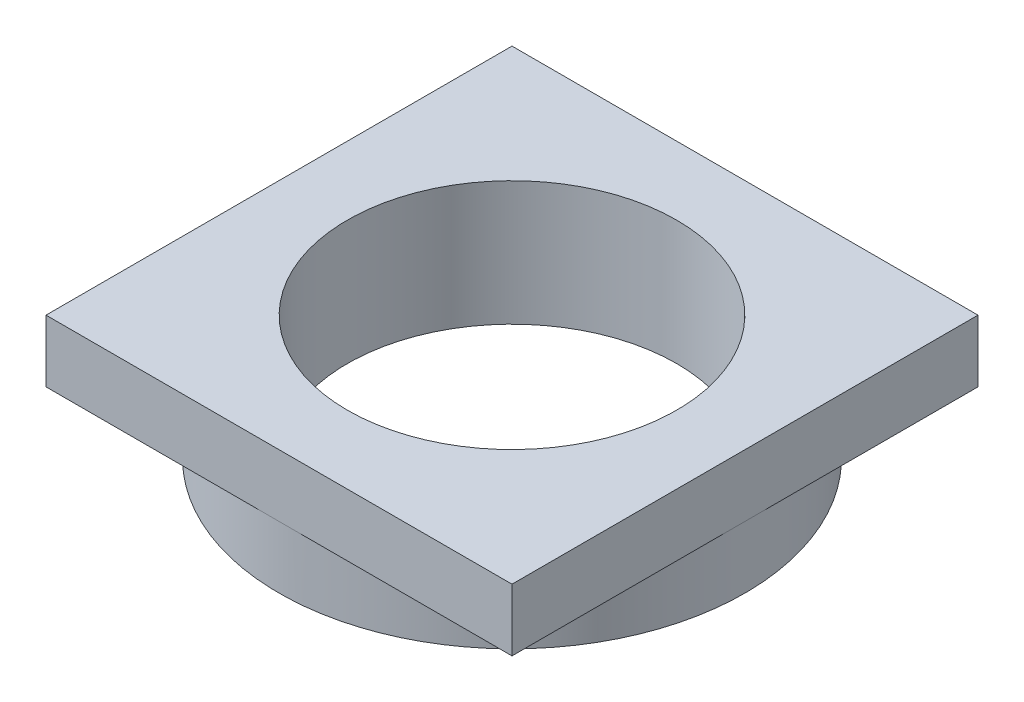
ISO-10303-21;
HEADER;
FILE_DESCRIPTION(('STEP AP214'),'2;1');
FILE_NAME('part.step','',(''),(''),'','','');
FILE_SCHEMA(('AUTOMOTIVE_DESIGN { 1 0 10303 214 1 1 1 1 }'));
ENDSEC;
DATA;
#1=APPLICATION_CONTEXT('core data for automotive mechanical design processes');
#2=APPLICATION_PROTOCOL_DEFINITION('international standard','automotive_design',2000,#1);
#3=PRODUCT_CONTEXT('',#1,'mechanical');
#4=PRODUCT('Part','Part','',(#3));
#5=PRODUCT_RELATED_PRODUCT_CATEGORY('part','',(#4));
#6=PRODUCT_DEFINITION_FORMATION('','',#4);
#7=PRODUCT_DEFINITION_CONTEXT('part definition',#1,'design');
#8=PRODUCT_DEFINITION('design','',#6,#7);
#9=PRODUCT_DEFINITION_SHAPE('','',#8);
#10=(LENGTH_UNIT() NAMED_UNIT(*) SI_UNIT(.MILLI.,.METRE.));
#11=(NAMED_UNIT(*) PLANE_ANGLE_UNIT() SI_UNIT($,.RADIAN.));
#12=(NAMED_UNIT(*) SI_UNIT($,.STERADIAN.) SOLID_ANGLE_UNIT());
#13=UNCERTAINTY_MEASURE_WITH_UNIT(LENGTH_MEASURE(1.E-05),#10,'distance_accuracy_value','');
#14=(GEOMETRIC_REPRESENTATION_CONTEXT(3) GLOBAL_UNCERTAINTY_ASSIGNED_CONTEXT((#13)) GLOBAL_UNIT_ASSIGNED_CONTEXT((#10,
#11,#12)) REPRESENTATION_CONTEXT('',''));
#15=CARTESIAN_POINT('',(0.,0.,0.));
#16=DIRECTION('',(0.,0.,1.));
#17=DIRECTION('',(1.,0.,0.));
#18=AXIS2_PLACEMENT_3D('',#15,#16,#17);
#19=CARTESIAN_POINT('',(0.,0.,0.));
#20=DIRECTION('',(0.,-1.,0.));
#21=DIRECTION('',(0.,0.,-1.));
#22=AXIS2_PLACEMENT_3D('',#19,#20,#21);
#23=PLANE('',#22);
#24=CARTESIAN_POINT('',(0.,0.,0.));
#25=DIRECTION('',(0.,-1.,0.));
#26=DIRECTION('',(0.,0.,-1.));
#27=AXIS2_PLACEMENT_3D('',#24,#25,#26);
#28=CIRCLE('',#27,37.5);
#29=CARTESIAN_POINT('',(0.,0.,-37.5));
#30=VERTEX_POINT('',#29);
#31=CARTESIAN_POINT('',(37.5,0.,0.));
#32=VERTEX_POINT('',#31);
#33=EDGE_CURVE('E43',#30,#32,#28,.T.);
#34=ORIENTED_EDGE('',*,*,#33,.F.);
#35=DIRECTION('',(-1.,0.,0.));
#36=VECTOR('',#35,1.);
#37=CARTESIAN_POINT('',(-37.5,0.,-37.5));
#38=LINE('',#37,#36);
#39=CARTESIAN_POINT('',(37.5,0.,-37.5));
#40=VERTEX_POINT('',#39);
#41=EDGE_CURVE('E90',#40,#30,#38,.T.);
#42=ORIENTED_EDGE('',*,*,#41,.F.);
#43=DIRECTION('',(0.,0.,-1.));
#44=VECTOR('',#43,1.);
#45=CARTESIAN_POINT('',(37.5,0.,37.5));
#46=LINE('',#45,#44);
#47=EDGE_CURVE('E106',#32,#40,#46,.T.);
#48=ORIENTED_EDGE('',*,*,#47,.F.);
#49=EDGE_LOOP('',(#34,#42,#48));
#50=FACE_BOUND('',#49,.T.);
#51=ADVANCED_FACE('F32',(#50),#23,.T.);
#52=CARTESIAN_POINT('',(0.,0.,37.5));
#53=VERTEX_POINT('',#52);
#54=EDGE_CURVE('E11',#32,#53,#28,.T.);
#55=ORIENTED_EDGE('',*,*,#54,.F.);
#56=CARTESIAN_POINT('',(37.5,0.,37.5));
#57=VERTEX_POINT('',#56);
#58=EDGE_CURVE('E104',#57,#32,#46,.T.);
#59=ORIENTED_EDGE('',*,*,#58,.F.);
#60=DIRECTION('',(1.,0.,0.));
#61=VECTOR('',#60,1.);
#62=CARTESIAN_POINT('',(-37.5,0.,37.5));
#63=LINE('',#62,#61);
#64=EDGE_CURVE('E132',#53,#57,#63,.T.);
#65=ORIENTED_EDGE('',*,*,#64,.F.);
#66=EDGE_LOOP('',(#55,#59,#65));
#67=FACE_BOUND('',#66,.T.);
#68=ADVANCED_FACE('F152',(#67),#23,.T.);
#69=CARTESIAN_POINT('',(-37.5,0.,0.));
#70=VERTEX_POINT('',#69);
#71=EDGE_CURVE('E41',#53,#70,#28,.T.);
#72=ORIENTED_EDGE('',*,*,#71,.F.);
#73=CARTESIAN_POINT('',(-37.5,0.,37.5));
#74=VERTEX_POINT('',#73);
#75=EDGE_CURVE('E123',#74,#53,#63,.T.);
#76=ORIENTED_EDGE('',*,*,#75,.F.);
#77=DIRECTION('',(0.,0.,1.));
#78=VECTOR('',#77,1.);
#79=CARTESIAN_POINT('',(-37.5,0.,37.5));
#80=LINE('',#79,#78);
#81=EDGE_CURVE('E99',#70,#74,#80,.T.);
#82=ORIENTED_EDGE('',*,*,#81,.F.);
#83=EDGE_LOOP('',(#72,#76,#82));
#84=FACE_BOUND('',#83,.T.);
#85=ADVANCED_FACE('F155',(#84),#23,.T.);
#86=CARTESIAN_POINT('',(0.,10.,0.));
#87=DIRECTION('',(0.,-1.,0.));
#88=DIRECTION('',(0.,0.,-1.));
#89=AXIS2_PLACEMENT_3D('',#86,#87,#88);
#90=PLANE('',#89);
#91=DIRECTION('',(0.,0.,-1.));
#92=VECTOR('',#91,1.);
#93=CARTESIAN_POINT('',(37.5,10.,37.5));
#94=LINE('',#93,#92);
#95=CARTESIAN_POINT('',(37.5,10.,37.5));
#96=VERTEX_POINT('',#95);
#97=CARTESIAN_POINT('',(37.5,10.,-37.5));
#98=VERTEX_POINT('',#97);
#99=EDGE_CURVE('E119',#96,#98,#94,.T.);
#100=ORIENTED_EDGE('',*,*,#99,.T.);
#101=DIRECTION('',(-1.,0.,0.));
#102=VECTOR('',#101,1.);
#103=CARTESIAN_POINT('',(-37.5,10.,-37.5));
#104=LINE('',#103,#102);
#105=CARTESIAN_POINT('',(-37.5,10.,-37.5));
#106=VERTEX_POINT('',#105);
#107=EDGE_CURVE('E122',#98,#106,#104,.T.);
#108=ORIENTED_EDGE('',*,*,#107,.T.);
#109=DIRECTION('',(0.,0.,1.));
#110=VECTOR('',#109,1.);
#111=CARTESIAN_POINT('',(-37.5,10.,37.5));
#112=LINE('',#111,#110);
#113=CARTESIAN_POINT('',(-37.5,10.,37.5));
#114=VERTEX_POINT('',#113);
#115=EDGE_CURVE('E125',#106,#114,#112,.T.);
#116=ORIENTED_EDGE('',*,*,#115,.T.);
#117=DIRECTION('',(1.,0.,0.));
#118=VECTOR('',#117,1.);
#119=CARTESIAN_POINT('',(-37.5,10.,37.5));
#120=LINE('',#119,#118);
#121=EDGE_CURVE('E127',#114,#96,#120,.T.);
#122=ORIENTED_EDGE('',*,*,#121,.T.);
#123=EDGE_LOOP('',(#100,#108,#116,#122));
#124=FACE_BOUND('',#123,.T.);
#125=CARTESIAN_POINT('',(0.,10.,0.));
#126=DIRECTION('',(0.,1.,0.));
#127=DIRECTION('',(0.,0.,1.));
#128=AXIS2_PLACEMENT_3D('',#125,#126,#127);
#129=CIRCLE('',#128,26.5);
#130=CARTESIAN_POINT('',(0.,10.,26.5));
#131=VERTEX_POINT('',#130);
#132=EDGE_CURVE('E116',#131,#131,#129,.T.);
#133=ORIENTED_EDGE('',*,*,#132,.F.);
#134=EDGE_LOOP('',(#133));
#135=FACE_BOUND('',#134,.T.);
#136=ADVANCED_FACE('F145',(#124,#135),#90,.F.);
#137=EDGE_CURVE('E50',#70,#30,#28,.T.);
#138=ORIENTED_EDGE('',*,*,#137,.F.);
#139=CARTESIAN_POINT('',(-37.5,0.,-37.5));
#140=VERTEX_POINT('',#139);
#141=EDGE_CURVE('E103',#140,#70,#80,.T.);
#142=ORIENTED_EDGE('',*,*,#141,.F.);
#143=EDGE_CURVE('E93',#30,#140,#38,.T.);
#144=ORIENTED_EDGE('',*,*,#143,.F.);
#145=EDGE_LOOP('',(#138,#142,#144));
#146=FACE_BOUND('',#145,.T.);
#147=ADVANCED_FACE('F101',(#146),#23,.T.);
#148=CARTESIAN_POINT('',(37.5,10.,37.5));
#149=DIRECTION('',(-1.,0.,0.));
#150=DIRECTION('',(0.,0.,1.));
#151=AXIS2_PLACEMENT_3D('',#148,#149,#150);
#152=PLANE('',#151);
#153=ORIENTED_EDGE('',*,*,#58,.T.);
#154=ORIENTED_EDGE('',*,*,#47,.T.);
#155=DIRECTION('',(0.,-1.,0.));
#156=VECTOR('',#155,1.);
#157=CARTESIAN_POINT('',(37.5,10.,-37.5));
#158=LINE('',#157,#156);
#159=EDGE_CURVE('E36',#98,#40,#158,.T.);
#160=ORIENTED_EDGE('',*,*,#159,.F.);
#161=ORIENTED_EDGE('',*,*,#99,.F.);
#162=DIRECTION('',(0.,-1.,0.));
#163=VECTOR('',#162,1.);
#164=CARTESIAN_POINT('',(37.5,10.,37.5));
#165=LINE('',#164,#163);
#166=EDGE_CURVE('E129',#96,#57,#165,.T.);
#167=ORIENTED_EDGE('',*,*,#166,.T.);
#168=EDGE_LOOP('',(#153,#154,#160,#161,#167));
#169=FACE_BOUND('',#168,.T.);
#170=ADVANCED_FACE('F34',(#169),#152,.F.);
#171=CARTESIAN_POINT('',(-37.5,10.,-37.5));
#172=DIRECTION('',(0.,0.,1.));
#173=DIRECTION('',(1.,0.,0.));
#174=AXIS2_PLACEMENT_3D('',#171,#172,#173);
#175=PLANE('',#174);
#176=ORIENTED_EDGE('',*,*,#41,.T.);
#177=ORIENTED_EDGE('',*,*,#143,.T.);
#178=DIRECTION('',(0.,-1.,0.));
#179=VECTOR('',#178,1.);
#180=CARTESIAN_POINT('',(-37.5,10.,-37.5));
#181=LINE('',#180,#179);
#182=EDGE_CURVE('E112',#106,#140,#181,.T.);
#183=ORIENTED_EDGE('',*,*,#182,.F.);
#184=ORIENTED_EDGE('',*,*,#107,.F.);
#185=ORIENTED_EDGE('',*,*,#159,.T.);
#186=EDGE_LOOP('',(#176,#177,#183,#184,#185));
#187=FACE_BOUND('',#186,.T.);
#188=ADVANCED_FACE('F91',(#187),#175,.F.);
#189=CARTESIAN_POINT('',(-37.5,10.,37.5));
#190=DIRECTION('',(1.,0.,0.));
#191=DIRECTION('',(0.,0.,-1.));
#192=AXIS2_PLACEMENT_3D('',#189,#190,#191);
#193=PLANE('',#192);
#194=ORIENTED_EDGE('',*,*,#141,.T.);
#195=ORIENTED_EDGE('',*,*,#81,.T.);
#196=DIRECTION('',(0.,-1.,0.));
#197=VECTOR('',#196,1.);
#198=CARTESIAN_POINT('',(-37.5,10.,37.5));
#199=LINE('',#198,#197);
#200=EDGE_CURVE('E137',#114,#74,#199,.T.);
#201=ORIENTED_EDGE('',*,*,#200,.F.);
#202=ORIENTED_EDGE('',*,*,#115,.F.);
#203=ORIENTED_EDGE('',*,*,#182,.T.);
#204=EDGE_LOOP('',(#194,#195,#201,#202,#203));
#205=FACE_BOUND('',#204,.T.);
#206=ADVANCED_FACE('F141',(#205),#193,.F.);
#207=CARTESIAN_POINT('',(-37.5,10.,37.5));
#208=DIRECTION('',(0.,0.,-1.));
#209=DIRECTION('',(-1.,0.,0.));
#210=AXIS2_PLACEMENT_3D('',#207,#208,#209);
#211=PLANE('',#210);
#212=ORIENTED_EDGE('',*,*,#75,.T.);
#213=ORIENTED_EDGE('',*,*,#64,.T.);
#214=ORIENTED_EDGE('',*,*,#166,.F.);
#215=ORIENTED_EDGE('',*,*,#121,.F.);
#216=ORIENTED_EDGE('',*,*,#200,.T.);
#217=EDGE_LOOP('',(#212,#213,#214,#215,#216));
#218=FACE_BOUND('',#217,.T.);
#219=ADVANCED_FACE('F154',(#218),#211,.F.);
#220=CARTESIAN_POINT('',(0.,10.,0.));
#221=DIRECTION('',(0.,-1.,0.));
#222=DIRECTION('',(0.,0.,-1.));
#223=AXIS2_PLACEMENT_3D('',#220,#221,#222);
#224=CYLINDRICAL_SURFACE('',#223,26.5);
#225=ORIENTED_EDGE('',*,*,#132,.T.);
#226=EDGE_LOOP('',(#225));
#227=FACE_BOUND('',#226,.T.);
#228=CARTESIAN_POINT('',(0.,-10.,0.));
#229=DIRECTION('',(0.,-1.,0.));
#230=DIRECTION('',(0.,0.,-1.));
#231=AXIS2_PLACEMENT_3D('',#228,#229,#230);
#232=CIRCLE('',#231,26.5);
#233=CARTESIAN_POINT('',(0.,-10.,-26.5));
#234=VERTEX_POINT('',#233);
#235=EDGE_CURVE('E110',#234,#234,#232,.T.);
#236=ORIENTED_EDGE('',*,*,#235,.T.);
#237=EDGE_LOOP('',(#236));
#238=FACE_BOUND('',#237,.T.);
#239=ADVANCED_FACE('F216',(#227,#238),#224,.F.);
#240=CARTESIAN_POINT('',(0.,-10.,0.));
#241=DIRECTION('',(0.,-1.,0.));
#242=DIRECTION('',(0.,0.,-1.));
#243=AXIS2_PLACEMENT_3D('',#240,#241,#242);
#244=PLANE('',#243);
#245=CARTESIAN_POINT('',(0.,-10.,0.));
#246=DIRECTION('',(0.,-1.,0.));
#247=DIRECTION('',(0.,0.,-1.));
#248=AXIS2_PLACEMENT_3D('',#245,#246,#247);
#249=CIRCLE('',#248,37.5);
#250=CARTESIAN_POINT('',(0.,-10.,-37.5));
#251=VERTEX_POINT('',#250);
#252=EDGE_CURVE('E109',#251,#251,#249,.T.);
#253=ORIENTED_EDGE('',*,*,#252,.T.);
#254=EDGE_LOOP('',(#253));
#255=FACE_BOUND('',#254,.T.);
#256=ORIENTED_EDGE('',*,*,#235,.F.);
#257=EDGE_LOOP('',(#256));
#258=FACE_BOUND('',#257,.T.);
#259=ADVANCED_FACE('F224',(#255,#258),#244,.T.);
#260=CARTESIAN_POINT('',(0.,-10.,0.));
#261=DIRECTION('',(0.,1.,0.));
#262=DIRECTION('',(0.,0.,1.));
#263=AXIS2_PLACEMENT_3D('',#260,#261,#262);
#264=CYLINDRICAL_SURFACE('',#263,37.5);
#265=ORIENTED_EDGE('',*,*,#252,.F.);
#266=EDGE_LOOP('',(#265));
#267=FACE_BOUND('',#266,.T.);
#268=ORIENTED_EDGE('',*,*,#33,.T.);
#269=ORIENTED_EDGE('',*,*,#54,.T.);
#270=ORIENTED_EDGE('',*,*,#71,.T.);
#271=ORIENTED_EDGE('',*,*,#137,.T.);
#272=EDGE_LOOP('',(#268,#269,#270,#271));
#273=FACE_BOUND('',#272,.T.);
#274=ADVANCED_FACE('F111',(#267,#273),#264,.T.);
#275=CLOSED_SHELL('',(#51,#68,#85,#136,#147,#170,#188,#206,#219,#239,#259,#274));
#276=MANIFOLD_SOLID_BREP('B2',#275);
#277=ADVANCED_BREP_SHAPE_REPRESENTATION('',(#18,#276),#14);
#278=SHAPE_DEFINITION_REPRESENTATION(#9,#277);
ENDSEC;
END-ISO-10303-21;
